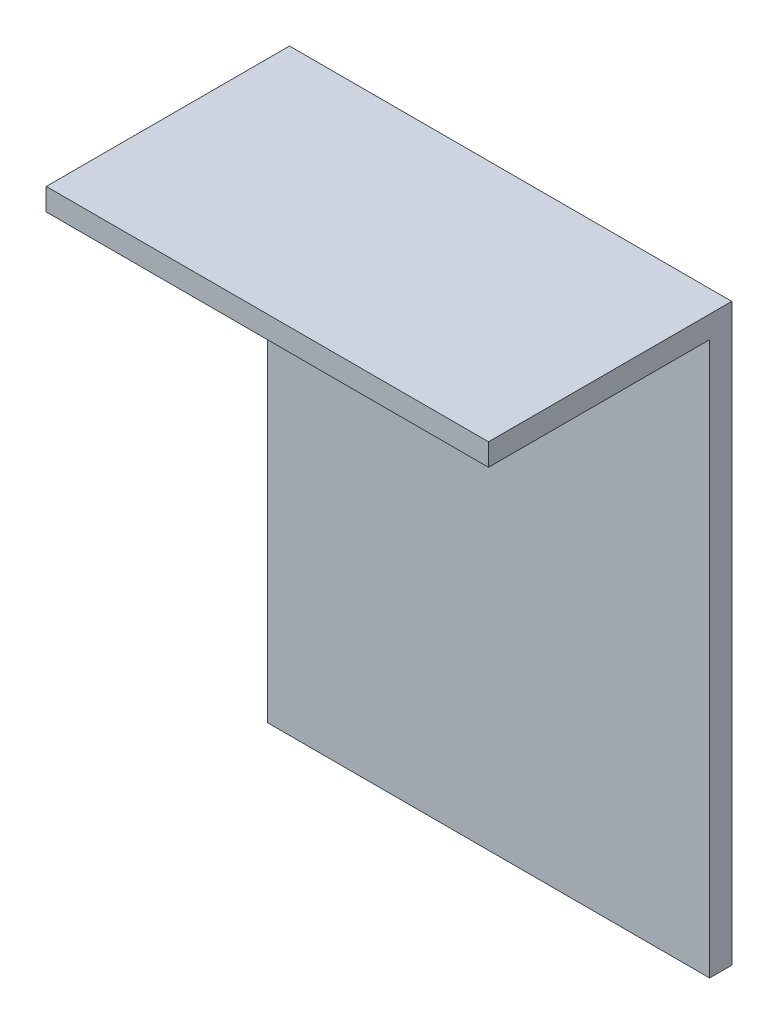
ISO-10303-21;
HEADER;
FILE_DESCRIPTION(('STEP AP214'),'2;1');
FILE_NAME('part.step','',(''),(''),'','','');
FILE_SCHEMA(('AUTOMOTIVE_DESIGN { 1 0 10303 214 1 1 1 1 }'));
ENDSEC;
DATA;
#1=APPLICATION_CONTEXT('core data for automotive mechanical design processes');
#2=APPLICATION_PROTOCOL_DEFINITION('international standard','automotive_design',2000,#1);
#3=PRODUCT_CONTEXT('',#1,'mechanical');
#4=PRODUCT('Part','Part','',(#3));
#5=PRODUCT_RELATED_PRODUCT_CATEGORY('part','',(#4));
#6=PRODUCT_DEFINITION_FORMATION('','',#4);
#7=PRODUCT_DEFINITION_CONTEXT('part definition',#1,'design');
#8=PRODUCT_DEFINITION('design','',#6,#7);
#9=PRODUCT_DEFINITION_SHAPE('','',#8);
#10=(LENGTH_UNIT() NAMED_UNIT(*) SI_UNIT(.MILLI.,.METRE.));
#11=(NAMED_UNIT(*) PLANE_ANGLE_UNIT() SI_UNIT($,.RADIAN.));
#12=(NAMED_UNIT(*) SI_UNIT($,.STERADIAN.) SOLID_ANGLE_UNIT());
#13=UNCERTAINTY_MEASURE_WITH_UNIT(LENGTH_MEASURE(1.E-05),#10,'distance_accuracy_value','');
#14=(GEOMETRIC_REPRESENTATION_CONTEXT(3) GLOBAL_UNCERTAINTY_ASSIGNED_CONTEXT((#13)) GLOBAL_UNIT_ASSIGNED_CONTEXT((#10,
#11,#12)) REPRESENTATION_CONTEXT('',''));
#15=CARTESIAN_POINT('',(0.,0.,0.));
#16=DIRECTION('',(0.,0.,1.));
#17=DIRECTION('',(1.,0.,0.));
#18=AXIS2_PLACEMENT_3D('',#15,#16,#17);
#19=CARTESIAN_POINT('',(0.,0.,2.54));
#20=DIRECTION('',(0.,0.,-1.));
#21=DIRECTION('',(-1.,0.,0.));
#22=AXIS2_PLACEMENT_3D('',#19,#20,#21);
#23=PLANE('',#22);
#24=DIRECTION('',(1.,0.,0.));
#25=VECTOR('',#24,1.);
#26=CARTESIAN_POINT('',(0.,63.5,2.54));
#27=LINE('',#26,#25);
#28=CARTESIAN_POINT('',(0.,63.5,2.54));
#29=VERTEX_POINT('',#28);
#30=CARTESIAN_POINT('',(50.8,63.5,2.54));
#31=VERTEX_POINT('',#30);
#32=EDGE_CURVE('E52',#29,#31,#27,.T.);
#33=ORIENTED_EDGE('',*,*,#32,.F.);
#34=DIRECTION('',(0.,-1.,0.));
#35=VECTOR('',#34,1.);
#36=CARTESIAN_POINT('',(0.,0.,2.54));
#37=LINE('',#36,#35);
#38=CARTESIAN_POINT('',(0.,0.,2.54));
#39=VERTEX_POINT('',#38);
#40=EDGE_CURVE('E89',#29,#39,#37,.T.);
#41=ORIENTED_EDGE('',*,*,#40,.T.);
#42=DIRECTION('',(1.,0.,0.));
#43=VECTOR('',#42,1.);
#44=CARTESIAN_POINT('',(0.,0.,2.54));
#45=LINE('',#44,#43);
#46=CARTESIAN_POINT('',(50.8,0.,2.54));
#47=VERTEX_POINT('',#46);
#48=EDGE_CURVE('E58',#39,#47,#45,.T.);
#49=ORIENTED_EDGE('',*,*,#48,.T.);
#50=DIRECTION('',(0.,1.,0.));
#51=VECTOR('',#50,1.);
#52=CARTESIAN_POINT('',(50.8,0.,2.54));
#53=LINE('',#52,#51);
#54=EDGE_CURVE('E100',#47,#31,#53,.T.);
#55=ORIENTED_EDGE('',*,*,#54,.T.);
#56=EDGE_LOOP('',(#33,#41,#49,#55));
#57=FACE_BOUND('',#56,.T.);
#58=ADVANCED_FACE('F35',(#57),#23,.F.);
#59=CARTESIAN_POINT('',(0.,0.,2.54));
#60=DIRECTION('',(1.,0.,0.));
#61=DIRECTION('',(0.,0.,-1.));
#62=AXIS2_PLACEMENT_3D('',#59,#60,#61);
#63=PLANE('',#62);
#64=DIRECTION('',(0.,-1.,0.));
#65=VECTOR('',#64,1.);
#66=CARTESIAN_POINT('',(0.,0.,0.));
#67=LINE('',#66,#65);
#68=CARTESIAN_POINT('',(0.,66.04,0.));
#69=VERTEX_POINT('',#68);
#70=CARTESIAN_POINT('',(0.,0.,0.));
#71=VERTEX_POINT('',#70);
#72=EDGE_CURVE('E96',#69,#71,#67,.T.);
#73=ORIENTED_EDGE('',*,*,#72,.T.);
#74=DIRECTION('',(0.,0.,-1.));
#75=VECTOR('',#74,1.);
#76=CARTESIAN_POINT('',(0.,0.,2.54));
#77=LINE('',#76,#75);
#78=EDGE_CURVE('E11',#39,#71,#77,.T.);
#79=ORIENTED_EDGE('',*,*,#78,.F.);
#80=ORIENTED_EDGE('',*,*,#40,.F.);
#81=DIRECTION('',(0.,0.,-1.));
#82=VECTOR('',#81,1.);
#83=CARTESIAN_POINT('',(0.,63.5,27.94));
#84=LINE('',#83,#82);
#85=CARTESIAN_POINT('',(0.,63.5,27.94));
#86=VERTEX_POINT('',#85);
#87=EDGE_CURVE('E104',#86,#29,#84,.T.);
#88=ORIENTED_EDGE('',*,*,#87,.F.);
#89=DIRECTION('',(0.,-1.,0.));
#90=VECTOR('',#89,1.);
#91=CARTESIAN_POINT('',(0.,66.04,27.94));
#92=LINE('',#91,#90);
#93=CARTESIAN_POINT('',(0.,66.04,27.94));
#94=VERTEX_POINT('',#93);
#95=EDGE_CURVE('E99',#94,#86,#92,.T.);
#96=ORIENTED_EDGE('',*,*,#95,.F.);
#97=DIRECTION('',(0.,0.,-1.));
#98=VECTOR('',#97,1.);
#99=CARTESIAN_POINT('',(0.,66.04,2.54));
#100=LINE('',#99,#98);
#101=EDGE_CURVE('E82',#94,#69,#100,.T.);
#102=ORIENTED_EDGE('',*,*,#101,.T.);
#103=EDGE_LOOP('',(#73,#79,#80,#88,#96,#102));
#104=FACE_BOUND('',#103,.T.);
#105=ADVANCED_FACE('F37',(#104),#63,.F.);
#106=CARTESIAN_POINT('',(0.,0.,2.54));
#107=DIRECTION('',(0.,1.,0.));
#108=DIRECTION('',(0.,0.,1.));
#109=AXIS2_PLACEMENT_3D('',#106,#107,#108);
#110=PLANE('',#109);
#111=DIRECTION('',(1.,0.,0.));
#112=VECTOR('',#111,1.);
#113=CARTESIAN_POINT('',(0.,0.,0.));
#114=LINE('',#113,#112);
#115=CARTESIAN_POINT('',(50.8,0.,0.));
#116=VERTEX_POINT('',#115);
#117=EDGE_CURVE('E103',#71,#116,#114,.T.);
#118=ORIENTED_EDGE('',*,*,#117,.T.);
#119=DIRECTION('',(0.,0.,-1.));
#120=VECTOR('',#119,1.);
#121=CARTESIAN_POINT('',(50.8,0.,2.54));
#122=LINE('',#121,#120);
#123=EDGE_CURVE('E44',#47,#116,#122,.T.);
#124=ORIENTED_EDGE('',*,*,#123,.F.);
#125=ORIENTED_EDGE('',*,*,#48,.F.);
#126=ORIENTED_EDGE('',*,*,#78,.T.);
#127=EDGE_LOOP('',(#118,#124,#125,#126));
#128=FACE_BOUND('',#127,.T.);
#129=ADVANCED_FACE('F151',(#128),#110,.F.);
#130=CARTESIAN_POINT('',(50.8,0.,2.54));
#131=DIRECTION('',(-1.,0.,0.));
#132=DIRECTION('',(0.,0.,1.));
#133=AXIS2_PLACEMENT_3D('',#130,#131,#132);
#134=PLANE('',#133);
#135=DIRECTION('',(0.,1.,0.));
#136=VECTOR('',#135,1.);
#137=CARTESIAN_POINT('',(50.8,0.,0.));
#138=LINE('',#137,#136);
#139=CARTESIAN_POINT('',(50.8,66.04,0.));
#140=VERTEX_POINT('',#139);
#141=EDGE_CURVE('E90',#116,#140,#138,.T.);
#142=ORIENTED_EDGE('',*,*,#141,.T.);
#143=DIRECTION('',(0.,0.,-1.));
#144=VECTOR('',#143,1.);
#145=CARTESIAN_POINT('',(50.8,66.04,2.54));
#146=LINE('',#145,#144);
#147=CARTESIAN_POINT('',(50.8,66.04,27.94));
#148=VERTEX_POINT('',#147);
#149=EDGE_CURVE('E85',#148,#140,#146,.T.);
#150=ORIENTED_EDGE('',*,*,#149,.F.);
#151=DIRECTION('',(0.,1.,0.));
#152=VECTOR('',#151,1.);
#153=CARTESIAN_POINT('',(50.8,66.04,27.94));
#154=LINE('',#153,#152);
#155=CARTESIAN_POINT('',(50.8,63.5,27.94));
#156=VERTEX_POINT('',#155);
#157=EDGE_CURVE('E137',#156,#148,#154,.T.);
#158=ORIENTED_EDGE('',*,*,#157,.F.);
#159=DIRECTION('',(0.,0.,-1.));
#160=VECTOR('',#159,1.);
#161=CARTESIAN_POINT('',(50.8,63.5,27.94));
#162=LINE('',#161,#160);
#163=EDGE_CURVE('E108',#156,#31,#162,.T.);
#164=ORIENTED_EDGE('',*,*,#163,.T.);
#165=ORIENTED_EDGE('',*,*,#54,.F.);
#166=ORIENTED_EDGE('',*,*,#123,.T.);
#167=EDGE_LOOP('',(#142,#150,#158,#164,#165,#166));
#168=FACE_BOUND('',#167,.T.);
#169=ADVANCED_FACE('F135',(#168),#134,.F.);
#170=CARTESIAN_POINT('',(0.,66.04,2.54));
#171=DIRECTION('',(0.,-1.,0.));
#172=DIRECTION('',(0.,0.,-1.));
#173=AXIS2_PLACEMENT_3D('',#170,#171,#172);
#174=PLANE('',#173);
#175=DIRECTION('',(-1.,0.,0.));
#176=VECTOR('',#175,1.);
#177=CARTESIAN_POINT('',(0.,66.04,0.));
#178=LINE('',#177,#176);
#179=EDGE_CURVE('E78',#140,#69,#178,.T.);
#180=ORIENTED_EDGE('',*,*,#179,.T.);
#181=ORIENTED_EDGE('',*,*,#101,.F.);
#182=DIRECTION('',(-1.,0.,0.));
#183=VECTOR('',#182,1.);
#184=CARTESIAN_POINT('',(0.,66.04,27.94));
#185=LINE('',#184,#183);
#186=EDGE_CURVE('E138',#148,#94,#185,.T.);
#187=ORIENTED_EDGE('',*,*,#186,.F.);
#188=ORIENTED_EDGE('',*,*,#149,.T.);
#189=EDGE_LOOP('',(#180,#181,#187,#188));
#190=FACE_BOUND('',#189,.T.);
#191=ADVANCED_FACE('F80',(#190),#174,.F.);
#192=CARTESIAN_POINT('',(0.,0.,0.));
#193=DIRECTION('',(0.,0.,-1.));
#194=DIRECTION('',(-1.,0.,0.));
#195=AXIS2_PLACEMENT_3D('',#192,#193,#194);
#196=PLANE('',#195);
#197=ORIENTED_EDGE('',*,*,#72,.F.);
#198=ORIENTED_EDGE('',*,*,#179,.F.);
#199=ORIENTED_EDGE('',*,*,#141,.F.);
#200=ORIENTED_EDGE('',*,*,#117,.F.);
#201=EDGE_LOOP('',(#197,#198,#199,#200));
#202=FACE_BOUND('',#201,.T.);
#203=ADVANCED_FACE('F102',(#202),#196,.T.);
#204=CARTESIAN_POINT('',(0.,63.5,27.94));
#205=DIRECTION('',(0.,1.,0.));
#206=DIRECTION('',(0.,0.,1.));
#207=AXIS2_PLACEMENT_3D('',#204,#205,#206);
#208=PLANE('',#207);
#209=ORIENTED_EDGE('',*,*,#32,.T.);
#210=ORIENTED_EDGE('',*,*,#163,.F.);
#211=DIRECTION('',(1.,0.,0.));
#212=VECTOR('',#211,1.);
#213=CARTESIAN_POINT('',(0.,63.5,27.94));
#214=LINE('',#213,#212);
#215=EDGE_CURVE('E143',#86,#156,#214,.T.);
#216=ORIENTED_EDGE('',*,*,#215,.F.);
#217=ORIENTED_EDGE('',*,*,#87,.T.);
#218=EDGE_LOOP('',(#209,#210,#216,#217));
#219=FACE_BOUND('',#218,.T.);
#220=ADVANCED_FACE('F131',(#219),#208,.F.);
#221=CARTESIAN_POINT('',(0.,0.,27.94));
#222=DIRECTION('',(0.,0.,1.));
#223=DIRECTION('',(1.,0.,0.));
#224=AXIS2_PLACEMENT_3D('',#221,#222,#223);
#225=PLANE('',#224);
#226=ORIENTED_EDGE('',*,*,#95,.T.);
#227=ORIENTED_EDGE('',*,*,#215,.T.);
#228=ORIENTED_EDGE('',*,*,#157,.T.);
#229=ORIENTED_EDGE('',*,*,#186,.T.);
#230=EDGE_LOOP('',(#226,#227,#228,#229));
#231=FACE_BOUND('',#230,.T.);
#232=ADVANCED_FACE('F148',(#231),#225,.T.);
#233=CLOSED_SHELL('',(#58,#105,#129,#169,#191,#203,#220,#232));
#234=MANIFOLD_SOLID_BREP('B2',#233);
#235=ADVANCED_BREP_SHAPE_REPRESENTATION('',(#18,#234),#14);
#236=SHAPE_DEFINITION_REPRESENTATION(#9,#235);
ENDSEC;
END-ISO-10303-21;
